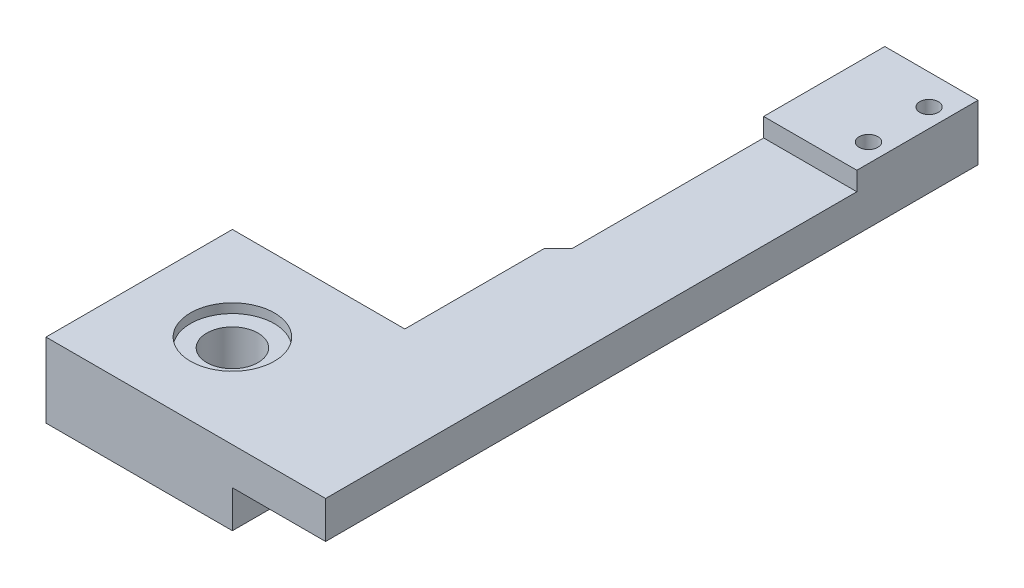
ISO-10303-21;
HEADER;
FILE_DESCRIPTION(('STEP AP214'),'2;1');
FILE_NAME('part.step','',(''),(''),'','','');
FILE_SCHEMA(('AUTOMOTIVE_DESIGN { 1 0 10303 214 1 1 1 1 }'));
ENDSEC;
DATA;
#1=APPLICATION_CONTEXT('core data for automotive mechanical design processes');
#2=APPLICATION_PROTOCOL_DEFINITION('international standard','automotive_design',2000,#1);
#3=PRODUCT_CONTEXT('',#1,'mechanical');
#4=PRODUCT('Part','Part','',(#3));
#5=PRODUCT_RELATED_PRODUCT_CATEGORY('part','',(#4));
#6=PRODUCT_DEFINITION_FORMATION('','',#4);
#7=PRODUCT_DEFINITION_CONTEXT('part definition',#1,'design');
#8=PRODUCT_DEFINITION('design','',#6,#7);
#9=PRODUCT_DEFINITION_SHAPE('','',#8);
#10=(LENGTH_UNIT() NAMED_UNIT(*) SI_UNIT(.MILLI.,.METRE.));
#11=(NAMED_UNIT(*) PLANE_ANGLE_UNIT() SI_UNIT($,.RADIAN.));
#12=(NAMED_UNIT(*) SI_UNIT($,.STERADIAN.) SOLID_ANGLE_UNIT());
#13=UNCERTAINTY_MEASURE_WITH_UNIT(LENGTH_MEASURE(1.E-05),#10,'distance_accuracy_value','');
#14=(GEOMETRIC_REPRESENTATION_CONTEXT(3) GLOBAL_UNCERTAINTY_ASSIGNED_CONTEXT((#13)) GLOBAL_UNIT_ASSIGNED_CONTEXT((#10,
#11,#12)) REPRESENTATION_CONTEXT('',''));
#15=CARTESIAN_POINT('',(0.,0.,0.));
#16=DIRECTION('',(0.,0.,1.));
#17=DIRECTION('',(1.,0.,0.));
#18=AXIS2_PLACEMENT_3D('',#15,#16,#17);
#19=CARTESIAN_POINT('',(0.,4.,0.));
#20=DIRECTION('',(0.,-1.,0.));
#21=DIRECTION('',(0.,0.,-1.));
#22=AXIS2_PLACEMENT_3D('',#19,#20,#21);
#23=PLANE('',#22);
#24=CARTESIAN_POINT('',(9.99999999999996,4.,-10.));
#25=DIRECTION('',(0.,1.,0.));
#26=DIRECTION('',(0.,0.,1.));
#27=AXIS2_PLACEMENT_3D('',#24,#25,#26);
#28=CIRCLE('',#27,4.5);
#29=CARTESIAN_POINT('',(9.99999999999996,4.,-5.5));
#30=VERTEX_POINT('',#29);
#31=EDGE_CURVE('E231',#30,#30,#28,.T.);
#32=ORIENTED_EDGE('',*,*,#31,.F.);
#33=EDGE_LOOP('',(#32));
#34=FACE_BOUND('',#33,.T.);
#35=DIRECTION('',(1.,0.,0.));
#36=VECTOR('',#35,1.);
#37=CARTESIAN_POINT('',(30.,4.,-57.));
#38=LINE('',#37,#36);
#39=CARTESIAN_POINT('',(20.,4.,-57.));
#40=VERTEX_POINT('',#39);
#41=CARTESIAN_POINT('',(30.,4.,-57.));
#42=VERTEX_POINT('',#41);
#43=EDGE_CURVE('E169',#40,#42,#38,.T.);
#44=ORIENTED_EDGE('',*,*,#43,.F.);
#45=DIRECTION('',(0.,0.,1.));
#46=VECTOR('',#45,1.);
#47=CARTESIAN_POINT('',(20.,4.,-70.));
#48=LINE('',#47,#46);
#49=CARTESIAN_POINT('',(20.,4.,-36.5));
#50=VERTEX_POINT('',#49);
#51=EDGE_CURVE('E228',#40,#50,#48,.T.);
#52=ORIENTED_EDGE('',*,*,#51,.T.);
#53=DIRECTION('',(0.707106781186551,0.,-0.707106781186544));
#54=VECTOR('',#53,1.);
#55=CARTESIAN_POINT('',(-8.25000000000009,4.,-8.25000000000017));
#56=LINE('',#55,#54);
#57=CARTESIAN_POINT('',(18.5,4.,-35.));
#58=VERTEX_POINT('',#57);
#59=EDGE_CURVE('E11',#50,#58,#56,.F.);
#60=ORIENTED_EDGE('',*,*,#59,.T.);
#61=DIRECTION('',(0.,0.,1.));
#62=VECTOR('',#61,1.);
#63=CARTESIAN_POINT('',(18.5,4.,-35.));
#64=LINE('',#63,#62);
#65=CARTESIAN_POINT('',(18.5,4.,-20.));
#66=VERTEX_POINT('',#65);
#67=EDGE_CURVE('E217',#58,#66,#64,.T.);
#68=ORIENTED_EDGE('',*,*,#67,.T.);
#69=DIRECTION('',(-1.,0.,0.));
#70=VECTOR('',#69,1.);
#71=CARTESIAN_POINT('',(0.,4.,-20.));
#72=LINE('',#71,#70);
#73=CARTESIAN_POINT('',(0.,4.,-20.));
#74=VERTEX_POINT('',#73);
#75=EDGE_CURVE('E284',#66,#74,#72,.T.);
#76=ORIENTED_EDGE('',*,*,#75,.T.);
#77=DIRECTION('',(0.,0.,1.));
#78=VECTOR('',#77,1.);
#79=CARTESIAN_POINT('',(0.,4.,0.));
#80=LINE('',#79,#78);
#81=CARTESIAN_POINT('',(0.,4.,0.));
#82=VERTEX_POINT('',#81);
#83=EDGE_CURVE('E274',#74,#82,#80,.T.);
#84=ORIENTED_EDGE('',*,*,#83,.T.);
#85=DIRECTION('',(1.,0.,0.));
#86=VECTOR('',#85,1.);
#87=CARTESIAN_POINT('',(0.,4.,0.));
#88=LINE('',#87,#86);
#89=CARTESIAN_POINT('',(30.,4.,0.));
#90=VERTEX_POINT('',#89);
#91=EDGE_CURVE('E278',#82,#90,#88,.T.);
#92=ORIENTED_EDGE('',*,*,#91,.T.);
#93=DIRECTION('',(0.,0.,-1.));
#94=VECTOR('',#93,1.);
#95=CARTESIAN_POINT('',(30.,4.,0.));
#96=LINE('',#95,#94);
#97=EDGE_CURVE('E281',#90,#42,#96,.T.);
#98=ORIENTED_EDGE('',*,*,#97,.T.);
#99=EDGE_LOOP('',(#44,#52,#60,#68,#76,#84,#92,#98));
#100=FACE_BOUND('',#99,.T.);
#101=ADVANCED_FACE('F40',(#34,#100),#23,.F.);
#102=CARTESIAN_POINT('',(0.,4.,0.));
#103=DIRECTION('',(1.,0.,0.));
#104=DIRECTION('',(0.,0.,-1.));
#105=AXIS2_PLACEMENT_3D('',#102,#103,#104);
#106=PLANE('',#105);
#107=DIRECTION('',(0.,-1.,0.));
#108=VECTOR('',#107,1.);
#109=CARTESIAN_POINT('',(0.,4.,-20.));
#110=LINE('',#109,#108);
#111=CARTESIAN_POINT('',(0.,-4.,-20.));
#112=VERTEX_POINT('',#111);
#113=EDGE_CURVE('E287',#74,#112,#110,.T.);
#114=ORIENTED_EDGE('',*,*,#113,.T.);
#115=DIRECTION('',(0.,0.,-1.));
#116=VECTOR('',#115,1.);
#117=CARTESIAN_POINT('',(0.,-4.,0.));
#118=LINE('',#117,#116);
#119=CARTESIAN_POINT('',(0.,-4.,0.));
#120=VERTEX_POINT('',#119);
#121=EDGE_CURVE('E248',#120,#112,#118,.T.);
#122=ORIENTED_EDGE('',*,*,#121,.F.);
#123=DIRECTION('',(0.,-1.,0.));
#124=VECTOR('',#123,1.);
#125=CARTESIAN_POINT('',(0.,4.,0.));
#126=LINE('',#125,#124);
#127=EDGE_CURVE('E297',#82,#120,#126,.T.);
#128=ORIENTED_EDGE('',*,*,#127,.F.);
#129=ORIENTED_EDGE('',*,*,#83,.F.);
#130=EDGE_LOOP('',(#114,#122,#128,#129));
#131=FACE_BOUND('',#130,.T.);
#132=ADVANCED_FACE('F336',(#131),#106,.F.);
#133=CARTESIAN_POINT('',(0.,4.,0.));
#134=DIRECTION('',(0.,0.,-1.));
#135=DIRECTION('',(-1.,0.,0.));
#136=AXIS2_PLACEMENT_3D('',#133,#134,#135);
#137=PLANE('',#136);
#138=ORIENTED_EDGE('',*,*,#127,.T.);
#139=DIRECTION('',(-1.,0.,0.));
#140=VECTOR('',#139,1.);
#141=CARTESIAN_POINT('',(0.,-4.,0.));
#142=LINE('',#141,#140);
#143=CARTESIAN_POINT('',(20.,-4.,0.));
#144=VERTEX_POINT('',#143);
#145=EDGE_CURVE('E258',#144,#120,#142,.T.);
#146=ORIENTED_EDGE('',*,*,#145,.F.);
#147=DIRECTION('',(0.,1.,0.));
#148=VECTOR('',#147,1.);
#149=CARTESIAN_POINT('',(20.,-4.,0.));
#150=LINE('',#149,#148);
#151=CARTESIAN_POINT('',(20.,0.,0.));
#152=VERTEX_POINT('',#151);
#153=EDGE_CURVE('E262',#144,#152,#150,.T.);
#154=ORIENTED_EDGE('',*,*,#153,.T.);
#155=DIRECTION('',(1.,0.,0.));
#156=VECTOR('',#155,1.);
#157=CARTESIAN_POINT('',(0.,0.,0.));
#158=LINE('',#157,#156);
#159=CARTESIAN_POINT('',(30.,0.,0.));
#160=VERTEX_POINT('',#159);
#161=EDGE_CURVE('E273',#152,#160,#158,.T.);
#162=ORIENTED_EDGE('',*,*,#161,.T.);
#163=DIRECTION('',(0.,-1.,0.));
#164=VECTOR('',#163,1.);
#165=CARTESIAN_POINT('',(30.,4.,0.));
#166=LINE('',#165,#164);
#167=EDGE_CURVE('E294',#90,#160,#166,.T.);
#168=ORIENTED_EDGE('',*,*,#167,.F.);
#169=ORIENTED_EDGE('',*,*,#91,.F.);
#170=EDGE_LOOP('',(#138,#146,#154,#162,#168,#169));
#171=FACE_BOUND('',#170,.T.);
#172=ADVANCED_FACE('F344',(#171),#137,.F.);
#173=CARTESIAN_POINT('',(30.,4.,0.));
#174=DIRECTION('',(-1.,0.,0.));
#175=DIRECTION('',(0.,0.,1.));
#176=AXIS2_PLACEMENT_3D('',#173,#174,#175);
#177=PLANE('',#176);
#178=DIRECTION('',(0.,0.,-1.));
#179=VECTOR('',#178,1.);
#180=CARTESIAN_POINT('',(30.,0.,0.));
#181=LINE('',#180,#179);
#182=CARTESIAN_POINT('',(30.,0.,-70.));
#183=VERTEX_POINT('',#182);
#184=EDGE_CURVE('E148',#160,#183,#181,.T.);
#185=ORIENTED_EDGE('',*,*,#184,.T.);
#186=DIRECTION('',(0.,-1.,0.));
#187=VECTOR('',#186,1.);
#188=CARTESIAN_POINT('',(30.,0.,-70.));
#189=LINE('',#188,#187);
#190=CARTESIAN_POINT('',(30.,6.,-70.));
#191=VERTEX_POINT('',#190);
#192=EDGE_CURVE('E140',#191,#183,#189,.T.);
#193=ORIENTED_EDGE('',*,*,#192,.F.);
#194=DIRECTION('',(0.,0.,-1.));
#195=VECTOR('',#194,1.);
#196=CARTESIAN_POINT('',(30.,6.,-70.));
#197=LINE('',#196,#195);
#198=CARTESIAN_POINT('',(30.,6.,-57.));
#199=VERTEX_POINT('',#198);
#200=EDGE_CURVE('E145',#199,#191,#197,.T.);
#201=ORIENTED_EDGE('',*,*,#200,.F.);
#202=DIRECTION('',(0.,-1.,0.));
#203=VECTOR('',#202,1.);
#204=CARTESIAN_POINT('',(30.,6.,-57.));
#205=LINE('',#204,#203);
#206=EDGE_CURVE('E182',#199,#42,#205,.T.);
#207=ORIENTED_EDGE('',*,*,#206,.T.);
#208=ORIENTED_EDGE('',*,*,#97,.F.);
#209=ORIENTED_EDGE('',*,*,#167,.T.);
#210=EDGE_LOOP('',(#185,#193,#201,#207,#208,#209));
#211=FACE_BOUND('',#210,.T.);
#212=ADVANCED_FACE('F142',(#211),#177,.F.);
#213=CARTESIAN_POINT('',(0.,4.,-20.));
#214=DIRECTION('',(0.,0.,1.));
#215=DIRECTION('',(1.,0.,0.));
#216=AXIS2_PLACEMENT_3D('',#213,#214,#215);
#217=PLANE('',#216);
#218=ORIENTED_EDGE('',*,*,#75,.F.);
#219=DIRECTION('',(0.,-1.,0.));
#220=VECTOR('',#219,1.);
#221=CARTESIAN_POINT('',(18.5,0.,-20.));
#222=LINE('',#221,#220);
#223=CARTESIAN_POINT('',(18.5,-1.5,-20.));
#224=VERTEX_POINT('',#223);
#225=EDGE_CURVE('E190',#66,#224,#222,.T.);
#226=ORIENTED_EDGE('',*,*,#225,.T.);
#227=DIRECTION('',(-1.,0.,0.));
#228=VECTOR('',#227,1.);
#229=CARTESIAN_POINT('',(0.,-1.5,-20.));
#230=LINE('',#229,#228);
#231=CARTESIAN_POINT('',(20.,-1.5,-20.));
#232=VERTEX_POINT('',#231);
#233=EDGE_CURVE('E206',#232,#224,#230,.T.);
#234=ORIENTED_EDGE('',*,*,#233,.F.);
#235=DIRECTION('',(0.,1.,0.));
#236=VECTOR('',#235,1.);
#237=CARTESIAN_POINT('',(20.,-4.,-20.));
#238=LINE('',#237,#236);
#239=CARTESIAN_POINT('',(20.,-4.,-20.));
#240=VERTEX_POINT('',#239);
#241=EDGE_CURVE('E269',#240,#232,#238,.T.);
#242=ORIENTED_EDGE('',*,*,#241,.F.);
#243=DIRECTION('',(1.,0.,0.));
#244=VECTOR('',#243,1.);
#245=CARTESIAN_POINT('',(0.,-4.,-20.));
#246=LINE('',#245,#244);
#247=EDGE_CURVE('E252',#112,#240,#246,.T.);
#248=ORIENTED_EDGE('',*,*,#247,.F.);
#249=ORIENTED_EDGE('',*,*,#113,.F.);
#250=EDGE_LOOP('',(#218,#226,#234,#242,#248,#249));
#251=FACE_BOUND('',#250,.T.);
#252=ADVANCED_FACE('F322',(#251),#217,.F.);
#253=CARTESIAN_POINT('',(0.,0.,0.));
#254=DIRECTION('',(0.,-1.,0.));
#255=DIRECTION('',(0.,0.,-1.));
#256=AXIS2_PLACEMENT_3D('',#253,#254,#255);
#257=PLANE('',#256);
#258=DIRECTION('',(0.,0.,1.));
#259=VECTOR('',#258,1.);
#260=CARTESIAN_POINT('',(20.,0.,0.));
#261=LINE('',#260,#259);
#262=CARTESIAN_POINT('',(20.,0.,-35.));
#263=VERTEX_POINT('',#262);
#264=EDGE_CURVE('E247',#263,#152,#261,.T.);
#265=ORIENTED_EDGE('',*,*,#264,.F.);
#266=DIRECTION('',(1.,0.,0.));
#267=VECTOR('',#266,1.);
#268=CARTESIAN_POINT('',(0.,0.,-35.));
#269=LINE('',#268,#267);
#270=CARTESIAN_POINT('',(18.5,0.,-35.));
#271=VERTEX_POINT('',#270);
#272=EDGE_CURVE('E300',#271,#263,#269,.T.);
#273=ORIENTED_EDGE('',*,*,#272,.F.);
#274=DIRECTION('',(-0.707106781186551,0.,0.707106781186544));
#275=VECTOR('',#274,1.);
#276=CARTESIAN_POINT('',(18.5,0.,-35.));
#277=LINE('',#276,#275);
#278=CARTESIAN_POINT('',(20.,0.,-36.5));
#279=VERTEX_POINT('',#278);
#280=EDGE_CURVE('E50',#271,#279,#277,.F.);
#281=ORIENTED_EDGE('',*,*,#280,.T.);
#282=DIRECTION('',(0.,0.,1.));
#283=VECTOR('',#282,1.);
#284=CARTESIAN_POINT('',(20.,0.,-70.));
#285=LINE('',#284,#283);
#286=CARTESIAN_POINT('',(20.,0.,-70.));
#287=VERTEX_POINT('',#286);
#288=EDGE_CURVE('E225',#287,#279,#285,.T.);
#289=ORIENTED_EDGE('',*,*,#288,.F.);
#290=DIRECTION('',(-1.,0.,0.));
#291=VECTOR('',#290,1.);
#292=CARTESIAN_POINT('',(0.,0.,-70.));
#293=LINE('',#292,#291);
#294=EDGE_CURVE('E152',#183,#287,#293,.T.);
#295=ORIENTED_EDGE('',*,*,#294,.F.);
#296=ORIENTED_EDGE('',*,*,#184,.F.);
#297=ORIENTED_EDGE('',*,*,#161,.F.);
#298=EDGE_LOOP('',(#265,#273,#281,#289,#295,#296,#297));
#299=FACE_BOUND('',#298,.T.);
#300=ADVANCED_FACE('F342',(#299),#257,.T.);
#301=CARTESIAN_POINT('',(20.,-4.,0.));
#302=DIRECTION('',(-1.,0.,0.));
#303=DIRECTION('',(0.,0.,1.));
#304=AXIS2_PLACEMENT_3D('',#301,#302,#303);
#305=PLANE('',#304);
#306=ORIENTED_EDGE('',*,*,#264,.T.);
#307=ORIENTED_EDGE('',*,*,#153,.F.);
#308=DIRECTION('',(0.,0.,1.));
#309=VECTOR('',#308,1.);
#310=CARTESIAN_POINT('',(20.,-4.,0.));
#311=LINE('',#310,#309);
#312=EDGE_CURVE('E255',#240,#144,#311,.T.);
#313=ORIENTED_EDGE('',*,*,#312,.F.);
#314=ORIENTED_EDGE('',*,*,#241,.T.);
#315=DIRECTION('',(0.,0.,1.));
#316=VECTOR('',#315,1.);
#317=CARTESIAN_POINT('',(20.,-1.5,-35.));
#318=LINE('',#317,#316);
#319=CARTESIAN_POINT('',(20.,-1.5,-35.));
#320=VERTEX_POINT('',#319);
#321=EDGE_CURVE('E213',#320,#232,#318,.T.);
#322=ORIENTED_EDGE('',*,*,#321,.F.);
#323=DIRECTION('',(0.,-1.,0.));
#324=VECTOR('',#323,1.);
#325=CARTESIAN_POINT('',(20.,0.,-35.));
#326=LINE('',#325,#324);
#327=EDGE_CURVE('E195',#263,#320,#326,.T.);
#328=ORIENTED_EDGE('',*,*,#327,.F.);
#329=EDGE_LOOP('',(#306,#307,#313,#314,#322,#328));
#330=FACE_BOUND('',#329,.T.);
#331=ADVANCED_FACE('F326',(#330),#305,.F.);
#332=CARTESIAN_POINT('',(0.,-4.,0.));
#333=DIRECTION('',(0.,-1.,0.));
#334=DIRECTION('',(0.,0.,-1.));
#335=AXIS2_PLACEMENT_3D('',#332,#333,#334);
#336=PLANE('',#335);
#337=CARTESIAN_POINT('',(9.99999999999996,-4.,-10.));
#338=DIRECTION('',(0.,1.,0.));
#339=DIRECTION('',(0.,0.,1.));
#340=AXIS2_PLACEMENT_3D('',#337,#338,#339);
#341=CIRCLE('',#340,2.75);
#342=CARTESIAN_POINT('',(9.99999999999996,-4.,-7.25));
#343=VERTEX_POINT('',#342);
#344=EDGE_CURVE('E243',#343,#343,#341,.T.);
#345=ORIENTED_EDGE('',*,*,#344,.T.);
#346=EDGE_LOOP('',(#345));
#347=FACE_BOUND('',#346,.T.);
#348=ORIENTED_EDGE('',*,*,#121,.T.);
#349=ORIENTED_EDGE('',*,*,#247,.T.);
#350=ORIENTED_EDGE('',*,*,#312,.T.);
#351=ORIENTED_EDGE('',*,*,#145,.T.);
#352=EDGE_LOOP('',(#348,#349,#350,#351));
#353=FACE_BOUND('',#352,.T.);
#354=ADVANCED_FACE('F330',(#347,#353),#336,.T.);
#355=CARTESIAN_POINT('',(9.99999999999996,4.,-10.));
#356=DIRECTION('',(0.,1.,0.));
#357=DIRECTION('',(0.,0.,1.));
#358=AXIS2_PLACEMENT_3D('',#355,#356,#357);
#359=CYLINDRICAL_SURFACE('',#358,2.75);
#360=ORIENTED_EDGE('',*,*,#344,.F.);
#361=EDGE_LOOP('',(#360));
#362=FACE_BOUND('',#361,.T.);
#363=CARTESIAN_POINT('',(9.99999999999996,3.,-10.));
#364=DIRECTION('',(0.,1.,0.));
#365=DIRECTION('',(0.,0.,1.));
#366=AXIS2_PLACEMENT_3D('',#363,#364,#365);
#367=CIRCLE('',#366,2.75);
#368=CARTESIAN_POINT('',(9.99999999999996,3.,-7.25));
#369=VERTEX_POINT('',#368);
#370=EDGE_CURVE('E239',#369,#369,#367,.T.);
#371=ORIENTED_EDGE('',*,*,#370,.T.);
#372=EDGE_LOOP('',(#371));
#373=FACE_BOUND('',#372,.T.);
#374=ADVANCED_FACE('F414',(#362,#373),#359,.F.);
#375=CARTESIAN_POINT('',(12.75,3.,-10.));
#376=DIRECTION('',(0.,-1.,0.));
#377=DIRECTION('',(0.,0.,-1.));
#378=AXIS2_PLACEMENT_3D('',#375,#376,#377);
#379=PLANE('',#378);
#380=ORIENTED_EDGE('',*,*,#370,.F.);
#381=EDGE_LOOP('',(#380));
#382=FACE_BOUND('',#381,.T.);
#383=CARTESIAN_POINT('',(9.99999999999996,3.,-10.));
#384=DIRECTION('',(0.,1.,0.));
#385=DIRECTION('',(0.,0.,1.));
#386=AXIS2_PLACEMENT_3D('',#383,#384,#385);
#387=CIRCLE('',#386,4.5);
#388=CARTESIAN_POINT('',(9.99999999999996,3.,-5.5));
#389=VERTEX_POINT('',#388);
#390=EDGE_CURVE('E235',#389,#389,#387,.T.);
#391=ORIENTED_EDGE('',*,*,#390,.T.);
#392=EDGE_LOOP('',(#391));
#393=FACE_BOUND('',#392,.T.);
#394=ADVANCED_FACE('F360',(#382,#393),#379,.F.);
#395=CARTESIAN_POINT('',(9.99999999999996,4.,-10.));
#396=DIRECTION('',(0.,1.,0.));
#397=DIRECTION('',(0.,0.,1.));
#398=AXIS2_PLACEMENT_3D('',#395,#396,#397);
#399=CYLINDRICAL_SURFACE('',#398,4.5);
#400=ORIENTED_EDGE('',*,*,#390,.F.);
#401=EDGE_LOOP('',(#400));
#402=FACE_BOUND('',#401,.T.);
#403=ORIENTED_EDGE('',*,*,#31,.T.);
#404=EDGE_LOOP('',(#403));
#405=FACE_BOUND('',#404,.T.);
#406=ADVANCED_FACE('F351',(#402,#405),#399,.F.);
#407=CARTESIAN_POINT('',(20.,0.,-70.));
#408=DIRECTION('',(-1.,0.,0.));
#409=DIRECTION('',(0.,0.,1.));
#410=AXIS2_PLACEMENT_3D('',#407,#408,#409);
#411=PLANE('',#410);
#412=ORIENTED_EDGE('',*,*,#288,.T.);
#413=DIRECTION('',(0.,1.,0.));
#414=VECTOR('',#413,1.);
#415=CARTESIAN_POINT('',(20.,4.,-36.5));
#416=LINE('',#415,#414);
#417=EDGE_CURVE('E63',#279,#50,#416,.T.);
#418=ORIENTED_EDGE('',*,*,#417,.T.);
#419=ORIENTED_EDGE('',*,*,#51,.F.);
#420=DIRECTION('',(0.,-1.,0.));
#421=VECTOR('',#420,1.);
#422=CARTESIAN_POINT('',(20.,6.,-57.));
#423=LINE('',#422,#421);
#424=CARTESIAN_POINT('',(20.,6.,-57.));
#425=VERTEX_POINT('',#424);
#426=EDGE_CURVE('E186',#425,#40,#423,.T.);
#427=ORIENTED_EDGE('',*,*,#426,.F.);
#428=DIRECTION('',(0.,0.,1.));
#429=VECTOR('',#428,1.);
#430=CARTESIAN_POINT('',(20.,6.,-70.));
#431=LINE('',#430,#429);
#432=CARTESIAN_POINT('',(20.,6.,-70.));
#433=VERTEX_POINT('',#432);
#434=EDGE_CURVE('E162',#433,#425,#431,.T.);
#435=ORIENTED_EDGE('',*,*,#434,.F.);
#436=DIRECTION('',(0.,-1.,0.));
#437=VECTOR('',#436,1.);
#438=CARTESIAN_POINT('',(20.,0.,-70.));
#439=LINE('',#438,#437);
#440=EDGE_CURVE('E153',#433,#287,#439,.T.);
#441=ORIENTED_EDGE('',*,*,#440,.T.);
#442=EDGE_LOOP('',(#412,#418,#419,#427,#435,#441));
#443=FACE_BOUND('',#442,.T.);
#444=ADVANCED_FACE('F349',(#443),#411,.T.);
#445=CARTESIAN_POINT('',(0.,0.,-70.));
#446=DIRECTION('',(0.,0.,-1.));
#447=DIRECTION('',(-1.,0.,0.));
#448=AXIS2_PLACEMENT_3D('',#445,#446,#447);
#449=PLANE('',#448);
#450=ORIENTED_EDGE('',*,*,#440,.F.);
#451=DIRECTION('',(-1.,0.,0.));
#452=VECTOR('',#451,1.);
#453=CARTESIAN_POINT('',(30.,6.,-70.));
#454=LINE('',#453,#452);
#455=EDGE_CURVE('E156',#191,#433,#454,.T.);
#456=ORIENTED_EDGE('',*,*,#455,.F.);
#457=ORIENTED_EDGE('',*,*,#192,.T.);
#458=ORIENTED_EDGE('',*,*,#294,.T.);
#459=EDGE_LOOP('',(#450,#456,#457,#458));
#460=FACE_BOUND('',#459,.T.);
#461=ADVANCED_FACE('F157',(#460),#449,.T.);
#462=CARTESIAN_POINT('',(18.5,0.,-35.));
#463=DIRECTION('',(-1.,0.,0.));
#464=DIRECTION('',(0.,0.,1.));
#465=AXIS2_PLACEMENT_3D('',#462,#463,#464);
#466=PLANE('',#465);
#467=ORIENTED_EDGE('',*,*,#225,.F.);
#468=ORIENTED_EDGE('',*,*,#67,.F.);
#469=DIRECTION('',(0.,-1.,0.));
#470=VECTOR('',#469,1.);
#471=CARTESIAN_POINT('',(18.5,0.,-35.));
#472=LINE('',#471,#470);
#473=EDGE_CURVE('E191',#58,#271,#472,.T.);
#474=ORIENTED_EDGE('',*,*,#473,.T.);
#475=CARTESIAN_POINT('',(18.5,-1.5,-35.));
#476=VERTEX_POINT('',#475);
#477=EDGE_CURVE('E196',#271,#476,#472,.T.);
#478=ORIENTED_EDGE('',*,*,#477,.T.);
#479=DIRECTION('',(0.,0.,1.));
#480=VECTOR('',#479,1.);
#481=CARTESIAN_POINT('',(18.5,-1.5,-35.));
#482=LINE('',#481,#480);
#483=EDGE_CURVE('E203',#476,#224,#482,.T.);
#484=ORIENTED_EDGE('',*,*,#483,.T.);
#485=EDGE_LOOP('',(#467,#468,#474,#478,#484));
#486=FACE_BOUND('',#485,.T.);
#487=ADVANCED_FACE('F309',(#486),#466,.T.);
#488=CARTESIAN_POINT('',(0.,-1.5,-35.));
#489=DIRECTION('',(0.,1.,0.));
#490=DIRECTION('',(0.,0.,1.));
#491=AXIS2_PLACEMENT_3D('',#488,#489,#490);
#492=PLANE('',#491);
#493=ORIENTED_EDGE('',*,*,#233,.T.);
#494=ORIENTED_EDGE('',*,*,#483,.F.);
#495=DIRECTION('',(-1.,0.,0.));
#496=VECTOR('',#495,1.);
#497=CARTESIAN_POINT('',(0.,-1.5,-35.));
#498=LINE('',#497,#496);
#499=EDGE_CURVE('E199',#320,#476,#498,.T.);
#500=ORIENTED_EDGE('',*,*,#499,.F.);
#501=ORIENTED_EDGE('',*,*,#321,.T.);
#502=EDGE_LOOP('',(#493,#494,#500,#501));
#503=FACE_BOUND('',#502,.T.);
#504=ADVANCED_FACE('F319',(#503),#492,.F.);
#505=CARTESIAN_POINT('',(0.,0.,-35.));
#506=DIRECTION('',(0.,0.,-1.));
#507=DIRECTION('',(-1.,0.,0.));
#508=AXIS2_PLACEMENT_3D('',#505,#506,#507);
#509=PLANE('',#508);
#510=ORIENTED_EDGE('',*,*,#477,.F.);
#511=ORIENTED_EDGE('',*,*,#272,.T.);
#512=ORIENTED_EDGE('',*,*,#327,.T.);
#513=ORIENTED_EDGE('',*,*,#499,.T.);
#514=EDGE_LOOP('',(#510,#511,#512,#513));
#515=FACE_BOUND('',#514,.T.);
#516=ADVANCED_FACE('F315',(#515),#509,.T.);
#517=CARTESIAN_POINT('',(30.,6.,-57.));
#518=DIRECTION('',(0.,0.,-1.));
#519=DIRECTION('',(-1.,0.,0.));
#520=AXIS2_PLACEMENT_3D('',#517,#518,#519);
#521=PLANE('',#520);
#522=ORIENTED_EDGE('',*,*,#43,.T.);
#523=ORIENTED_EDGE('',*,*,#206,.F.);
#524=DIRECTION('',(1.,0.,0.));
#525=VECTOR('',#524,1.);
#526=CARTESIAN_POINT('',(30.,6.,-57.));
#527=LINE('',#526,#525);
#528=EDGE_CURVE('E166',#425,#199,#527,.T.);
#529=ORIENTED_EDGE('',*,*,#528,.F.);
#530=ORIENTED_EDGE('',*,*,#426,.T.);
#531=EDGE_LOOP('',(#522,#523,#529,#530));
#532=FACE_BOUND('',#531,.T.);
#533=ADVANCED_FACE('F347',(#532),#521,.F.);
#534=CARTESIAN_POINT('',(0.,6.,0.));
#535=DIRECTION('',(0.,-1.,0.));
#536=DIRECTION('',(0.,0.,-1.));
#537=AXIS2_PLACEMENT_3D('',#534,#535,#536);
#538=PLANE('',#537);
#539=CARTESIAN_POINT('',(28.,6.,-60.25));
#540=DIRECTION('',(0.,1.,0.));
#541=DIRECTION('',(0.,0.,1.));
#542=AXIS2_PLACEMENT_3D('',#539,#540,#541);
#543=CIRCLE('',#542,1.);
#544=CARTESIAN_POINT('',(28.,6.,-59.25));
#545=VERTEX_POINT('',#544);
#546=EDGE_CURVE('E527',#545,#545,#543,.T.);
#547=ORIENTED_EDGE('',*,*,#546,.F.);
#548=EDGE_LOOP('',(#547));
#549=FACE_BOUND('',#548,.T.);
#550=CARTESIAN_POINT('',(28.,6.,-66.75));
#551=DIRECTION('',(0.,1.,0.));
#552=DIRECTION('',(0.,0.,1.));
#553=AXIS2_PLACEMENT_3D('',#550,#551,#552);
#554=CIRCLE('',#553,1.);
#555=CARTESIAN_POINT('',(28.,6.,-65.75));
#556=VERTEX_POINT('',#555);
#557=EDGE_CURVE('E176',#556,#556,#554,.T.);
#558=ORIENTED_EDGE('',*,*,#557,.F.);
#559=EDGE_LOOP('',(#558));
#560=FACE_BOUND('',#559,.T.);
#561=ORIENTED_EDGE('',*,*,#200,.T.);
#562=ORIENTED_EDGE('',*,*,#455,.T.);
#563=ORIENTED_EDGE('',*,*,#434,.T.);
#564=ORIENTED_EDGE('',*,*,#528,.T.);
#565=EDGE_LOOP('',(#561,#562,#563,#564));
#566=FACE_BOUND('',#565,.T.);
#567=ADVANCED_FACE('F164',(#549,#560,#566),#538,.F.);
#568=CARTESIAN_POINT('',(28.,2.,-66.75));
#569=DIRECTION('',(0.,1.,0.));
#570=DIRECTION('',(0.,0.,1.));
#571=AXIS2_PLACEMENT_3D('',#568,#569,#570);
#572=CYLINDRICAL_SURFACE('',#571,1.);
#573=CARTESIAN_POINT('',(28.,2.,-66.75));
#574=DIRECTION('',(0.,1.,0.));
#575=DIRECTION('',(0.,0.,1.));
#576=AXIS2_PLACEMENT_3D('',#573,#574,#575);
#577=CIRCLE('',#576,1.);
#578=CARTESIAN_POINT('',(28.,2.,-65.75));
#579=VERTEX_POINT('',#578);
#580=EDGE_CURVE('E531',#579,#579,#577,.T.);
#581=ORIENTED_EDGE('',*,*,#580,.F.);
#582=EDGE_LOOP('',(#581));
#583=FACE_BOUND('',#582,.T.);
#584=ORIENTED_EDGE('',*,*,#557,.T.);
#585=EDGE_LOOP('',(#584));
#586=FACE_BOUND('',#585,.T.);
#587=ADVANCED_FACE('F475',(#583,#586),#572,.F.);
#588=CARTESIAN_POINT('',(28.,2.,-66.75));
#589=DIRECTION('',(0.,1.,0.));
#590=DIRECTION('',(0.,0.,1.));
#591=AXIS2_PLACEMENT_3D('',#588,#589,#590);
#592=PLANE('',#591);
#593=ORIENTED_EDGE('',*,*,#580,.T.);
#594=EDGE_LOOP('',(#593));
#595=FACE_BOUND('',#594,.T.);
#596=ADVANCED_FACE('F485',(#595),#592,.T.);
#597=CARTESIAN_POINT('',(28.,2.,-60.25));
#598=DIRECTION('',(0.,1.,0.));
#599=DIRECTION('',(0.,0.,1.));
#600=AXIS2_PLACEMENT_3D('',#597,#598,#599);
#601=CYLINDRICAL_SURFACE('',#600,1.);
#602=CARTESIAN_POINT('',(28.,2.,-60.25));
#603=DIRECTION('',(0.,1.,0.));
#604=DIRECTION('',(0.,0.,1.));
#605=AXIS2_PLACEMENT_3D('',#602,#603,#604);
#606=CIRCLE('',#605,1.);
#607=CARTESIAN_POINT('',(28.,2.,-59.25));
#608=VERTEX_POINT('',#607);
#609=EDGE_CURVE('E173',#608,#608,#606,.T.);
#610=ORIENTED_EDGE('',*,*,#609,.F.);
#611=EDGE_LOOP('',(#610));
#612=FACE_BOUND('',#611,.T.);
#613=ORIENTED_EDGE('',*,*,#546,.T.);
#614=EDGE_LOOP('',(#613));
#615=FACE_BOUND('',#614,.T.);
#616=ADVANCED_FACE('F492',(#612,#615),#601,.F.);
#617=CARTESIAN_POINT('',(28.,2.,-60.25));
#618=DIRECTION('',(0.,1.,0.));
#619=DIRECTION('',(0.,0.,1.));
#620=AXIS2_PLACEMENT_3D('',#617,#618,#619);
#621=PLANE('',#620);
#622=ORIENTED_EDGE('',*,*,#609,.T.);
#623=EDGE_LOOP('',(#622));
#624=FACE_BOUND('',#623,.T.);
#625=ADVANCED_FACE('F500',(#624),#621,.T.);
#626=CARTESIAN_POINT('',(18.5,0.,-35.));
#627=DIRECTION('',(-0.707106781186544,0.,-0.707106781186551));
#628=DIRECTION('',(0.,1.,0.));
#629=AXIS2_PLACEMENT_3D('',#626,#627,#628);
#630=PLANE('',#629);
#631=ORIENTED_EDGE('',*,*,#59,.F.);
#632=ORIENTED_EDGE('',*,*,#417,.F.);
#633=ORIENTED_EDGE('',*,*,#280,.F.);
#634=ORIENTED_EDGE('',*,*,#473,.F.);
#635=EDGE_LOOP('',(#631,#632,#633,#634));
#636=FACE_BOUND('',#635,.T.);
#637=ADVANCED_FACE('F43',(#636),#630,.T.);
#638=CLOSED_SHELL('',(#101,#132,#172,#212,#252,#300,#331,#354,#374,#394,#406,#444,#461,#487,
#504,#516,#533,#567,#587,#596,#616,#625,#637));
#639=MANIFOLD_SOLID_BREP('B2',#638);
#640=ADVANCED_BREP_SHAPE_REPRESENTATION('',(#18,#639),#14);
#641=SHAPE_DEFINITION_REPRESENTATION(#9,#640);
ENDSEC;
END-ISO-10303-21;
